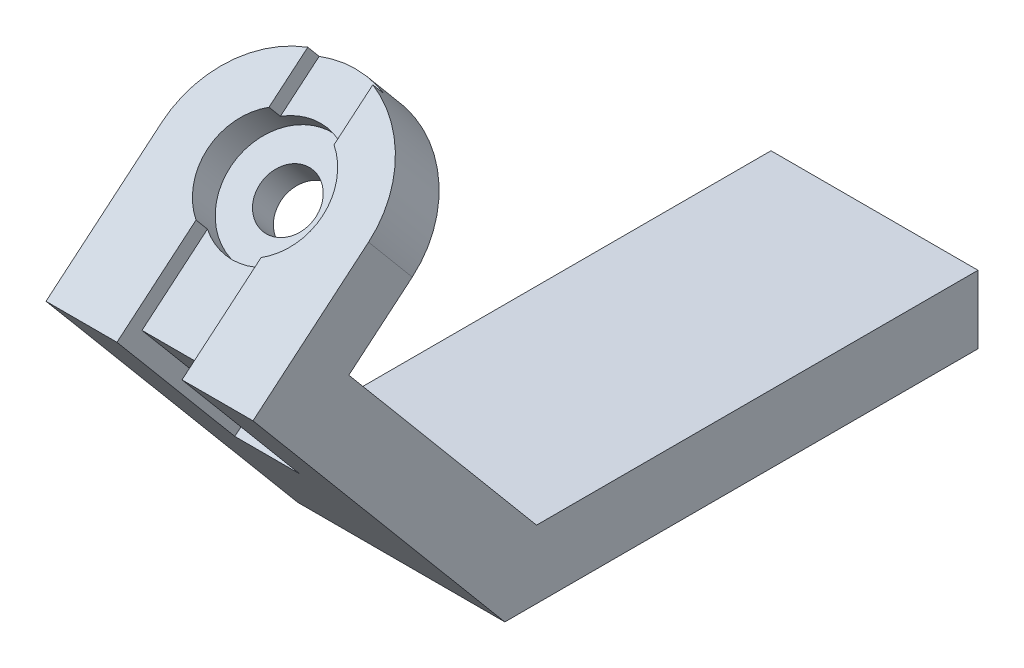
ISO-10303-21;
HEADER;
FILE_DESCRIPTION(('STEP AP214'),'2;1');
FILE_NAME('part.step','',(''),(''),'','','');
FILE_SCHEMA(('AUTOMOTIVE_DESIGN { 1 0 10303 214 1 1 1 1 }'));
ENDSEC;
DATA;
#1=APPLICATION_CONTEXT('core data for automotive mechanical design processes');
#2=APPLICATION_PROTOCOL_DEFINITION('international standard','automotive_design',2000,#1);
#3=PRODUCT_CONTEXT('',#1,'mechanical');
#4=PRODUCT('Part','Part','',(#3));
#5=PRODUCT_RELATED_PRODUCT_CATEGORY('part','',(#4));
#6=PRODUCT_DEFINITION_FORMATION('','',#4);
#7=PRODUCT_DEFINITION_CONTEXT('part definition',#1,'design');
#8=PRODUCT_DEFINITION('design','',#6,#7);
#9=PRODUCT_DEFINITION_SHAPE('','',#8);
#10=(LENGTH_UNIT() NAMED_UNIT(*) SI_UNIT(.MILLI.,.METRE.));
#11=(NAMED_UNIT(*) PLANE_ANGLE_UNIT() SI_UNIT($,.RADIAN.));
#12=(NAMED_UNIT(*) SI_UNIT($,.STERADIAN.) SOLID_ANGLE_UNIT());
#13=UNCERTAINTY_MEASURE_WITH_UNIT(LENGTH_MEASURE(1.E-05),#10,'distance_accuracy_value','');
#14=(GEOMETRIC_REPRESENTATION_CONTEXT(3) GLOBAL_UNCERTAINTY_ASSIGNED_CONTEXT((#13)) GLOBAL_UNIT_ASSIGNED_CONTEXT((#10,
#11,#12)) REPRESENTATION_CONTEXT('',''));
#15=CARTESIAN_POINT('',(0.,0.,0.));
#16=DIRECTION('',(0.,0.,1.));
#17=DIRECTION('',(1.,0.,0.));
#18=AXIS2_PLACEMENT_3D('',#15,#16,#17);
#19=CARTESIAN_POINT('',(0.,162.190581611374,136.094057210534));
#20=DIRECTION('',(0.,-0.766044443118974,-0.642787609686544));
#21=DIRECTION('',(0.,0.642787609686544,-0.766044443118974));
#22=AXIS2_PLACEMENT_3D('',#19,#20,#21);
#23=PLANE('',#22);
#24=DIRECTION('',(-1.,0.,0.));
#25=VECTOR('',#24,1.);
#26=CARTESIAN_POINT('',(-46.,77.7596410716863,236.714933924814));
#27=LINE('',#26,#25);
#28=CARTESIAN_POINT('',(-24.,77.7596410716862,236.714933924814));
#29=VERTEX_POINT('',#28);
#30=CARTESIAN_POINT('',(-46.,77.7596410716863,236.714933924814));
#31=VERTEX_POINT('',#30);
#32=EDGE_CURVE('E188',#29,#31,#27,.T.);
#33=ORIENTED_EDGE('',*,*,#32,.F.);
#34=DIRECTION('',(0.,0.642787609686544,-0.766044443118974));
#35=VECTOR('',#34,1.);
#36=CARTESIAN_POINT('',(-24.,73.902915413567,241.311200583528));
#37=LINE('',#36,#35);
#38=CARTESIAN_POINT('',(-24.,96.3354045285049,214.577201089971));
#39=VERTEX_POINT('',#38);
#40=EDGE_CURVE('E72',#29,#39,#37,.T.);
#41=ORIENTED_EDGE('',*,*,#40,.T.);
#42=CARTESIAN_POINT('',(-35.,106.685083507581,202.242933984461));
#43=DIRECTION('',(0.,-0.766044443118974,-0.642787609686544));
#44=DIRECTION('',(0.,0.642787609686544,-0.766044443118974));
#45=AXIS2_PLACEMENT_3D('',#42,#43,#44);
#46=CIRCLE('',#45,19.5);
#47=CARTESIAN_POINT('',(-46.,96.3354045285049,214.577201089971));
#48=VERTEX_POINT('',#47);
#49=EDGE_CURVE('E311',#48,#39,#46,.F.);
#50=ORIENTED_EDGE('',*,*,#49,.F.);
#51=DIRECTION('',(0.,-0.642787609686544,0.766044443118974));
#52=VECTOR('',#51,1.);
#53=CARTESIAN_POINT('',(-46.,73.902915413567,241.311200583528));
#54=LINE('',#53,#52);
#55=EDGE_CURVE('E204',#48,#31,#54,.T.);
#56=ORIENTED_EDGE('',*,*,#55,.T.);
#57=EDGE_LOOP('',(#33,#41,#50,#56));
#58=FACE_BOUND('',#57,.T.);
#59=ADVANCED_FACE('F50',(#58),#23,.F.);
#60=CARTESIAN_POINT('',(-70.,111.281350166295,206.09965964258));
#61=DIRECTION('',(0.,0.766044443118974,0.642787609686544));
#62=DIRECTION('',(0.,-0.642787609686544,0.766044443118974));
#63=AXIS2_PLACEMENT_3D('',#60,#61,#62);
#64=PLANE('',#63);
#65=DIRECTION('',(0.,-0.642787609686544,0.766044443118974));
#66=VECTOR('',#65,1.);
#67=CARTESIAN_POINT('',(-46.,78.4991820722808,245.167926241647));
#68=LINE('',#67,#66);
#69=CARTESIAN_POINT('',(-46.,132.638929755936,180.646687437508));
#70=VERTEX_POINT('',#69);
#71=CARTESIAN_POINT('',(-46.,121.631029145371,193.765392537069));
#72=VERTEX_POINT('',#71);
#73=EDGE_CURVE('E211',#70,#72,#68,.T.);
#74=ORIENTED_EDGE('',*,*,#73,.F.);
#75=CARTESIAN_POINT('',(-35.,111.281350166295,206.09965964258));
#76=DIRECTION('',(0.,0.766044443118974,0.642787609686544));
#77=DIRECTION('',(0.,-0.642787609686544,0.766044443118974));
#78=AXIS2_PLACEMENT_3D('',#75,#76,#77);
#79=CIRCLE('',#78,35.);
#80=CARTESIAN_POINT('',(-70.,111.281350166295,206.09965964258));
#81=VERTEX_POINT('',#80);
#82=EDGE_CURVE('E243',#81,#70,#79,.F.);
#83=ORIENTED_EDGE('',*,*,#82,.F.);
#84=DIRECTION('',(0.,-0.642787609686544,0.766044443118974));
#85=VECTOR('',#84,1.);
#86=CARTESIAN_POINT('',(-70.,111.281350166295,206.09965964258));
#87=LINE('',#86,#85);
#88=CARTESIAN_POINT('',(-70.,78.4991820722808,245.167926241647));
#89=VERTEX_POINT('',#88);
#90=EDGE_CURVE('E262',#81,#89,#87,.T.);
#91=ORIENTED_EDGE('',*,*,#90,.T.);
#92=DIRECTION('',(1.,0.,0.));
#93=VECTOR('',#92,1.);
#94=CARTESIAN_POINT('',(-70.,78.4991820722808,245.167926241647));
#95=LINE('',#94,#93);
#96=CARTESIAN_POINT('',(-46.,78.4991820722808,245.167926241647));
#97=VERTEX_POINT('',#96);
#98=EDGE_CURVE('E299',#89,#97,#95,.T.);
#99=ORIENTED_EDGE('',*,*,#98,.T.);
#100=CARTESIAN_POINT('',(-46.,100.931671187219,218.43392674809));
#101=VERTEX_POINT('',#100);
#102=EDGE_CURVE('E202',#101,#97,#68,.T.);
#103=ORIENTED_EDGE('',*,*,#102,.F.);
#104=CARTESIAN_POINT('',(-35.,111.281350166295,206.09965964258));
#105=DIRECTION('',(0.,0.766044443118974,0.642787609686544));
#106=DIRECTION('',(0.,-0.642787609686544,0.766044443118974));
#107=AXIS2_PLACEMENT_3D('',#104,#105,#106);
#108=CIRCLE('',#107,19.5);
#109=EDGE_CURVE('E226',#72,#101,#108,.T.);
#110=ORIENTED_EDGE('',*,*,#109,.F.);
#111=EDGE_LOOP('',(#74,#83,#91,#99,#103,#110));
#112=FACE_BOUND('',#111,.T.);
#113=ADVANCED_FACE('F327',(#112),#64,.T.);
#114=CARTESIAN_POINT('',(-35.,93.6623279745582,191.315544619789));
#115=DIRECTION('',(0.,0.766044443118974,0.642787609686544));
#116=DIRECTION('',(0.,-0.642787609686544,0.766044443118974));
#117=AXIS2_PLACEMENT_3D('',#114,#115,#116);
#118=CYLINDRICAL_SURFACE('',#117,9.5);
#119=CARTESIAN_POINT('',(-35.,93.6623279745582,191.315544619789));
#120=DIRECTION('',(0.,0.766044443118974,0.642787609686544));
#121=DIRECTION('',(0.,-0.642787609686544,0.766044443118974));
#122=AXIS2_PLACEMENT_3D('',#119,#120,#121);
#123=CIRCLE('',#122,9.5);
#124=CARTESIAN_POINT('',(-35.,87.555845682536,198.59296682942));
#125=VERTEX_POINT('',#124);
#126=EDGE_CURVE('E234',#125,#125,#123,.T.);
#127=ORIENTED_EDGE('',*,*,#126,.F.);
#128=EDGE_LOOP('',(#127));
#129=FACE_BOUND('',#128,.T.);
#130=CARTESIAN_POINT('',(-35.,102.088816848867,198.386208326341));
#131=DIRECTION('',(0.,0.766044443118974,0.642787609686544));
#132=DIRECTION('',(0.,-0.642787609686544,0.766044443118974));
#133=AXIS2_PLACEMENT_3D('',#130,#131,#132);
#134=CIRCLE('',#133,9.5);
#135=CARTESIAN_POINT('',(-35.,95.9823345568448,205.663630535971));
#136=VERTEX_POINT('',#135);
#137=EDGE_CURVE('E227',#136,#136,#134,.T.);
#138=ORIENTED_EDGE('',*,*,#137,.T.);
#139=EDGE_LOOP('',(#138));
#140=FACE_BOUND('',#139,.T.);
#141=ADVANCED_FACE('F392',(#129,#140),#118,.F.);
#142=CARTESIAN_POINT('',(-70.,-23.,0.));
#143=DIRECTION('',(0.,0.,-1.));
#144=DIRECTION('',(-1.,0.,0.));
#145=AXIS2_PLACEMENT_3D('',#142,#143,#144);
#146=PLANE('',#145);
#147=DIRECTION('',(0.,1.,0.));
#148=VECTOR('',#147,1.);
#149=CARTESIAN_POINT('',(0.,-23.,0.));
#150=LINE('',#149,#148);
#151=CARTESIAN_POINT('',(0.,-23.,0.));
#152=VERTEX_POINT('',#151);
#153=CARTESIAN_POINT('',(0.,0.,0.));
#154=VERTEX_POINT('',#153);
#155=EDGE_CURVE('E242',#152,#154,#150,.T.);
#156=ORIENTED_EDGE('',*,*,#155,.F.);
#157=DIRECTION('',(1.,0.,0.));
#158=VECTOR('',#157,1.);
#159=CARTESIAN_POINT('',(-70.,-23.,0.));
#160=LINE('',#159,#158);
#161=CARTESIAN_POINT('',(-70.,-23.,0.));
#162=VERTEX_POINT('',#161);
#163=EDGE_CURVE('E294',#162,#152,#160,.T.);
#164=ORIENTED_EDGE('',*,*,#163,.F.);
#165=DIRECTION('',(0.,1.,0.));
#166=VECTOR('',#165,1.);
#167=CARTESIAN_POINT('',(-70.,-23.,0.));
#168=LINE('',#167,#166);
#169=CARTESIAN_POINT('',(-70.,0.,0.));
#170=VERTEX_POINT('',#169);
#171=EDGE_CURVE('E246',#162,#170,#168,.T.);
#172=ORIENTED_EDGE('',*,*,#171,.T.);
#173=DIRECTION('',(1.,0.,0.));
#174=VECTOR('',#173,1.);
#175=CARTESIAN_POINT('',(-70.,0.,0.));
#176=LINE('',#175,#174);
#177=EDGE_CURVE('E271',#170,#154,#176,.T.);
#178=ORIENTED_EDGE('',*,*,#177,.T.);
#179=EDGE_LOOP('',(#156,#164,#172,#178));
#180=FACE_BOUND('',#179,.T.);
#181=ADVANCED_FACE('F52',(#180),#146,.T.);
#182=CARTESIAN_POINT('',(-70.,-23.,160.));
#183=DIRECTION('',(0.,-1.,0.));
#184=DIRECTION('',(0.,0.,-1.));
#185=AXIS2_PLACEMENT_3D('',#182,#183,#184);
#186=PLANE('',#185);
#187=DIRECTION('',(0.,0.,-1.));
#188=VECTOR('',#187,1.);
#189=CARTESIAN_POINT('',(0.,-23.,160.));
#190=LINE('',#189,#188);
#191=CARTESIAN_POINT('',(0.,-23.,160.));
#192=VERTEX_POINT('',#191);
#193=EDGE_CURVE('E250',#192,#152,#190,.T.);
#194=ORIENTED_EDGE('',*,*,#193,.F.);
#195=DIRECTION('',(1.,0.,0.));
#196=VECTOR('',#195,1.);
#197=CARTESIAN_POINT('',(-70.,-23.,160.));
#198=LINE('',#197,#196);
#199=CARTESIAN_POINT('',(-70.,-23.,160.));
#200=VERTEX_POINT('',#199);
#201=EDGE_CURVE('E297',#200,#192,#198,.T.);
#202=ORIENTED_EDGE('',*,*,#201,.F.);
#203=DIRECTION('',(0.,0.,-1.));
#204=VECTOR('',#203,1.);
#205=CARTESIAN_POINT('',(-70.,-23.,160.));
#206=LINE('',#205,#204);
#207=EDGE_CURVE('E268',#200,#162,#206,.T.);
#208=ORIENTED_EDGE('',*,*,#207,.T.);
#209=ORIENTED_EDGE('',*,*,#163,.T.);
#210=EDGE_LOOP('',(#194,#202,#208,#209));
#211=FACE_BOUND('',#210,.T.);
#212=ADVANCED_FACE('F372',(#211),#186,.T.);
#213=CARTESIAN_POINT('',(-70.,78.4991820722808,245.167926241647));
#214=DIRECTION('',(0.,-0.642787609686544,0.766044443118974));
#215=DIRECTION('',(0.,-0.766044443118974,-0.642787609686544));
#216=AXIS2_PLACEMENT_3D('',#213,#214,#215);
#217=PLANE('',#216);
#218=DIRECTION('',(1.,0.,0.));
#219=VECTOR('',#218,1.);
#220=CARTESIAN_POINT('',(-46.,31.0044265989044,205.315094441082));
#221=LINE('',#220,#219);
#222=CARTESIAN_POINT('',(-46.,31.0044265989044,205.315094441082));
#223=VERTEX_POINT('',#222);
#224=CARTESIAN_POINT('',(-24.,31.0044265989044,205.315094441082));
#225=VERTEX_POINT('',#224);
#226=EDGE_CURVE('E196',#223,#225,#221,.T.);
#227=ORIENTED_EDGE('',*,*,#226,.F.);
#228=DIRECTION('',(0.,0.766044443118974,0.642787609686544));
#229=VECTOR('',#228,1.);
#230=CARTESIAN_POINT('',(-46.,73.902915413567,241.311200583528));
#231=LINE('',#230,#229);
#232=EDGE_CURVE('E183',#223,#97,#231,.T.);
#233=ORIENTED_EDGE('',*,*,#232,.T.);
#234=ORIENTED_EDGE('',*,*,#98,.F.);
#235=DIRECTION('',(0.,-0.766044443118974,-0.642787609686544));
#236=VECTOR('',#235,1.);
#237=CARTESIAN_POINT('',(-70.,78.4991820722808,245.167926241647));
#238=LINE('',#237,#236);
#239=EDGE_CURVE('E265',#89,#200,#238,.T.);
#240=ORIENTED_EDGE('',*,*,#239,.T.);
#241=ORIENTED_EDGE('',*,*,#201,.T.);
#242=DIRECTION('',(0.,-0.766044443118974,-0.642787609686544));
#243=VECTOR('',#242,1.);
#244=CARTESIAN_POINT('',(0.,78.4991820722808,245.167926241647));
#245=LINE('',#244,#243);
#246=CARTESIAN_POINT('',(0.,78.4991820722808,245.167926241647));
#247=VERTEX_POINT('',#246);
#248=EDGE_CURVE('E289',#247,#192,#245,.T.);
#249=ORIENTED_EDGE('',*,*,#248,.F.);
#250=CARTESIAN_POINT('',(-24.,78.4991820722808,245.167926241647));
#251=VERTEX_POINT('',#250);
#252=EDGE_CURVE('E302',#251,#247,#95,.T.);
#253=ORIENTED_EDGE('',*,*,#252,.F.);
#254=DIRECTION('',(0.,0.766044443118974,0.642787609686544));
#255=VECTOR('',#254,1.);
#256=CARTESIAN_POINT('',(-24.,73.902915413567,241.311200583528));
#257=LINE('',#256,#255);
#258=EDGE_CURVE('E214',#225,#251,#257,.T.);
#259=ORIENTED_EDGE('',*,*,#258,.F.);
#260=EDGE_LOOP('',(#227,#233,#234,#240,#241,#249,#253,#259));
#261=FACE_BOUND('',#260,.T.);
#262=ADVANCED_FACE('F374',(#261),#217,.T.);
#263=DIRECTION('',(0.,0.642787609686544,-0.766044443118974));
#264=VECTOR('',#263,1.);
#265=CARTESIAN_POINT('',(-24.,78.4991820722808,245.167926241647));
#266=LINE('',#265,#264);
#267=CARTESIAN_POINT('',(-24.,100.931671187219,218.43392674809));
#268=VERTEX_POINT('',#267);
#269=EDGE_CURVE('E207',#251,#268,#266,.T.);
#270=ORIENTED_EDGE('',*,*,#269,.F.);
#271=ORIENTED_EDGE('',*,*,#252,.T.);
#272=DIRECTION('',(0.,-0.642787609686544,0.766044443118974));
#273=VECTOR('',#272,1.);
#274=CARTESIAN_POINT('',(0.,111.281350166295,206.09965964258));
#275=LINE('',#274,#273);
#276=CARTESIAN_POINT('',(0.,111.281350166295,206.09965964258));
#277=VERTEX_POINT('',#276);
#278=EDGE_CURVE('E286',#277,#247,#275,.T.);
#279=ORIENTED_EDGE('',*,*,#278,.F.);
#280=CARTESIAN_POINT('',(-24.,132.638929755936,180.646687437508));
#281=VERTEX_POINT('',#280);
#282=EDGE_CURVE('E239',#281,#277,#79,.F.);
#283=ORIENTED_EDGE('',*,*,#282,.F.);
#284=CARTESIAN_POINT('',(-24.,121.631029145371,193.765392537069));
#285=VERTEX_POINT('',#284);
#286=EDGE_CURVE('E213',#285,#281,#266,.T.);
#287=ORIENTED_EDGE('',*,*,#286,.F.);
#288=EDGE_CURVE('E231',#268,#285,#108,.T.);
#289=ORIENTED_EDGE('',*,*,#288,.F.);
#290=EDGE_LOOP('',(#270,#271,#279,#283,#287,#289));
#291=FACE_BOUND('',#290,.T.);
#292=ADVANCED_FACE('F344',(#291),#64,.T.);
#293=CARTESIAN_POINT('',(-70.,75.6642749033349,212.764789027121));
#294=DIRECTION('',(0.,-0.766044443118975,-0.642787609686543));
#295=DIRECTION('',(0.,0.642787609686543,-0.766044443118975));
#296=AXIS2_PLACEMENT_3D('',#293,#294,#295);
#297=PLANE('',#296);
#298=ORIENTED_EDGE('',*,*,#126,.T.);
#299=EDGE_LOOP('',(#298));
#300=FACE_BOUND('',#299,.T.);
#301=DIRECTION('',(0.,0.642787609686543,-0.766044443118975));
#302=VECTOR('',#301,1.);
#303=CARTESIAN_POINT('',(-70.,75.6642749033349,212.764789027121));
#304=LINE('',#303,#302);
#305=CARTESIAN_POINT('',(-70.,75.6642749033349,212.764789027121));
#306=VERTEX_POINT('',#305);
#307=CARTESIAN_POINT('',(-70.,93.6623279745582,191.315544619789));
#308=VERTEX_POINT('',#307);
#309=EDGE_CURVE('E256',#306,#308,#304,.T.);
#310=ORIENTED_EDGE('',*,*,#309,.T.);
#311=CARTESIAN_POINT('',(-35.,93.6623279745582,191.315544619789));
#312=DIRECTION('',(0.,0.766044443118974,0.642787609686544));
#313=DIRECTION('',(0.,-0.642787609686544,0.766044443118974));
#314=AXIS2_PLACEMENT_3D('',#311,#312,#313);
#315=CIRCLE('',#314,35.);
#316=CARTESIAN_POINT('',(0.,93.6623279745582,191.315544619789));
#317=VERTEX_POINT('',#316);
#318=EDGE_CURVE('E240',#308,#317,#315,.F.);
#319=ORIENTED_EDGE('',*,*,#318,.T.);
#320=DIRECTION('',(0.,0.642787609686543,-0.766044443118975));
#321=VECTOR('',#320,1.);
#322=CARTESIAN_POINT('',(0.,75.6642749033349,212.764789027121));
#323=LINE('',#322,#321);
#324=CARTESIAN_POINT('',(0.,75.6642749033349,212.764789027121));
#325=VERTEX_POINT('',#324);
#326=EDGE_CURVE('E280',#325,#317,#323,.T.);
#327=ORIENTED_EDGE('',*,*,#326,.F.);
#328=DIRECTION('',(1.,0.,0.));
#329=VECTOR('',#328,1.);
#330=CARTESIAN_POINT('',(-70.,75.6642749033349,212.764789027121));
#331=LINE('',#330,#329);
#332=EDGE_CURVE('E303',#306,#325,#331,.T.);
#333=ORIENTED_EDGE('',*,*,#332,.F.);
#334=EDGE_LOOP('',(#310,#319,#327,#333));
#335=FACE_BOUND('',#334,.T.);
#336=ADVANCED_FACE('F359',(#300,#335),#297,.T.);
#337=CARTESIAN_POINT('',(-70.,0.,149.274923862435));
#338=DIRECTION('',(0.,0.642787609686544,-0.766044443118974));
#339=DIRECTION('',(0.,0.766044443118974,0.642787609686544));
#340=AXIS2_PLACEMENT_3D('',#337,#338,#339);
#341=PLANE('',#340);
#342=DIRECTION('',(0.,0.766044443118974,0.642787609686544));
#343=VECTOR('',#342,1.);
#344=CARTESIAN_POINT('',(0.,0.,149.274923862435));
#345=LINE('',#344,#343);
#346=CARTESIAN_POINT('',(0.,0.,149.274923862435));
#347=VERTEX_POINT('',#346);
#348=EDGE_CURVE('E277',#347,#325,#345,.T.);
#349=ORIENTED_EDGE('',*,*,#348,.F.);
#350=DIRECTION('',(1.,0.,0.));
#351=VECTOR('',#350,1.);
#352=CARTESIAN_POINT('',(-70.,0.,149.274923862435));
#353=LINE('',#352,#351);
#354=CARTESIAN_POINT('',(-70.,0.,149.274923862435));
#355=VERTEX_POINT('',#354);
#356=EDGE_CURVE('E305',#355,#347,#353,.T.);
#357=ORIENTED_EDGE('',*,*,#356,.F.);
#358=DIRECTION('',(0.,0.766044443118974,0.642787609686544));
#359=VECTOR('',#358,1.);
#360=CARTESIAN_POINT('',(-70.,0.,149.274923862435));
#361=LINE('',#360,#359);
#362=EDGE_CURVE('E253',#355,#306,#361,.T.);
#363=ORIENTED_EDGE('',*,*,#362,.T.);
#364=ORIENTED_EDGE('',*,*,#332,.T.);
#365=EDGE_LOOP('',(#349,#357,#363,#364));
#366=FACE_BOUND('',#365,.T.);
#367=ADVANCED_FACE('F362',(#366),#341,.T.);
#368=CARTESIAN_POINT('',(-70.,0.,0.));
#369=DIRECTION('',(0.,1.,0.));
#370=DIRECTION('',(0.,0.,1.));
#371=AXIS2_PLACEMENT_3D('',#368,#369,#370);
#372=PLANE('',#371);
#373=DIRECTION('',(0.,0.,1.));
#374=VECTOR('',#373,1.);
#375=CARTESIAN_POINT('',(0.,0.,0.));
#376=LINE('',#375,#374);
#377=EDGE_CURVE('E274',#154,#347,#376,.T.);
#378=ORIENTED_EDGE('',*,*,#377,.F.);
#379=ORIENTED_EDGE('',*,*,#177,.F.);
#380=DIRECTION('',(0.,0.,1.));
#381=VECTOR('',#380,1.);
#382=CARTESIAN_POINT('',(-70.,0.,0.));
#383=LINE('',#382,#381);
#384=EDGE_CURVE('E249',#170,#355,#383,.T.);
#385=ORIENTED_EDGE('',*,*,#384,.T.);
#386=ORIENTED_EDGE('',*,*,#356,.T.);
#387=EDGE_LOOP('',(#378,#379,#385,#386));
#388=FACE_BOUND('',#387,.T.);
#389=ADVANCED_FACE('F366',(#388),#372,.T.);
#390=CARTESIAN_POINT('',(-70.,0.,0.));
#391=DIRECTION('',(1.,0.,0.));
#392=DIRECTION('',(0.,0.,-1.));
#393=AXIS2_PLACEMENT_3D('',#390,#391,#392);
#394=PLANE('',#393);
#395=ORIENTED_EDGE('',*,*,#171,.F.);
#396=ORIENTED_EDGE('',*,*,#207,.F.);
#397=ORIENTED_EDGE('',*,*,#239,.F.);
#398=ORIENTED_EDGE('',*,*,#90,.F.);
#399=DIRECTION('',(0.,0.766044443118975,0.642787609686543));
#400=VECTOR('',#399,1.);
#401=CARTESIAN_POINT('',(-70.,93.6623279745581,191.315544619789));
#402=LINE('',#401,#400);
#403=EDGE_CURVE('E259',#308,#81,#402,.T.);
#404=ORIENTED_EDGE('',*,*,#403,.F.);
#405=ORIENTED_EDGE('',*,*,#309,.F.);
#406=ORIENTED_EDGE('',*,*,#362,.F.);
#407=ORIENTED_EDGE('',*,*,#384,.F.);
#408=EDGE_LOOP('',(#395,#396,#397,#398,#404,#405,#406,#407));
#409=FACE_BOUND('',#408,.T.);
#410=ADVANCED_FACE('F356',(#409),#394,.F.);
#411=CARTESIAN_POINT('',(0.,0.,0.));
#412=DIRECTION('',(1.,0.,0.));
#413=DIRECTION('',(0.,0.,-1.));
#414=AXIS2_PLACEMENT_3D('',#411,#412,#413);
#415=PLANE('',#414);
#416=ORIENTED_EDGE('',*,*,#155,.T.);
#417=ORIENTED_EDGE('',*,*,#377,.T.);
#418=ORIENTED_EDGE('',*,*,#348,.T.);
#419=ORIENTED_EDGE('',*,*,#326,.T.);
#420=DIRECTION('',(0.,0.766044443118975,0.642787609686543));
#421=VECTOR('',#420,1.);
#422=CARTESIAN_POINT('',(0.,93.6623279745581,191.315544619789));
#423=LINE('',#422,#421);
#424=EDGE_CURVE('E283',#317,#277,#423,.T.);
#425=ORIENTED_EDGE('',*,*,#424,.T.);
#426=ORIENTED_EDGE('',*,*,#278,.T.);
#427=ORIENTED_EDGE('',*,*,#248,.T.);
#428=ORIENTED_EDGE('',*,*,#193,.T.);
#429=EDGE_LOOP('',(#416,#417,#418,#419,#425,#426,#427,#428));
#430=FACE_BOUND('',#429,.T.);
#431=ADVANCED_FACE('F348',(#430),#415,.T.);
#432=CARTESIAN_POINT('',(-35.,93.6623279745582,191.315544619789));
#433=DIRECTION('',(0.,0.766044443118974,0.642787609686544));
#434=DIRECTION('',(0.,-0.642787609686544,0.766044443118974));
#435=AXIS2_PLACEMENT_3D('',#432,#433,#434);
#436=CYLINDRICAL_SURFACE('',#435,35.);
#437=ORIENTED_EDGE('',*,*,#82,.T.);
#438=DIRECTION('',(0.,0.766044443118974,0.642787609686544));
#439=VECTOR('',#438,1.);
#440=CARTESIAN_POINT('',(-46.,115.019907564199,165.862572414718));
#441=LINE('',#440,#439);
#442=CARTESIAN_POINT('',(-46.,128.042663097222,176.789961779389));
#443=VERTEX_POINT('',#442);
#444=EDGE_CURVE('E223',#70,#443,#441,.F.);
#445=ORIENTED_EDGE('',*,*,#444,.T.);
#446=CARTESIAN_POINT('',(-35.,106.685083507581,202.242933984461));
#447=DIRECTION('',(0.,-0.766044443118974,-0.642787609686544));
#448=DIRECTION('',(0.,0.642787609686544,-0.766044443118974));
#449=AXIS2_PLACEMENT_3D('',#446,#447,#448);
#450=CIRCLE('',#449,35.);
#451=CARTESIAN_POINT('',(-24.,128.042663097222,176.789961779389));
#452=VERTEX_POINT('',#451);
#453=EDGE_CURVE('E216',#443,#452,#450,.T.);
#454=ORIENTED_EDGE('',*,*,#453,.T.);
#455=DIRECTION('',(0.,0.766044443118974,0.642787609686544));
#456=VECTOR('',#455,1.);
#457=CARTESIAN_POINT('',(-24.,115.019907564199,165.862572414718));
#458=LINE('',#457,#456);
#459=EDGE_CURVE('E220',#452,#281,#458,.T.);
#460=ORIENTED_EDGE('',*,*,#459,.T.);
#461=ORIENTED_EDGE('',*,*,#282,.T.);
#462=ORIENTED_EDGE('',*,*,#424,.F.);
#463=ORIENTED_EDGE('',*,*,#318,.F.);
#464=ORIENTED_EDGE('',*,*,#403,.T.);
#465=EDGE_LOOP('',(#437,#445,#454,#460,#461,#462,#463,#464));
#466=FACE_BOUND('',#465,.T.);
#467=ADVANCED_FACE('F340',(#466),#436,.T.);
#468=CARTESIAN_POINT('',(-35.,102.088816848867,198.386208326341));
#469=DIRECTION('',(0.,0.766044443118974,0.642787609686544));
#470=DIRECTION('',(0.,-0.642787609686544,0.766044443118974));
#471=AXIS2_PLACEMENT_3D('',#468,#469,#470);
#472=CYLINDRICAL_SURFACE('',#471,19.5);
#473=ORIENTED_EDGE('',*,*,#109,.T.);
#474=DIRECTION('',(0.,0.766044443118974,0.642787609686544));
#475=VECTOR('',#474,1.);
#476=CARTESIAN_POINT('',(-46.,91.739137869791,210.720475431852));
#477=LINE('',#476,#475);
#478=EDGE_CURVE('E12',#101,#48,#477,.F.);
#479=ORIENTED_EDGE('',*,*,#478,.T.);
#480=ORIENTED_EDGE('',*,*,#49,.T.);
#481=DIRECTION('',(0.,0.766044443118974,0.642787609686544));
#482=VECTOR('',#481,1.);
#483=CARTESIAN_POINT('',(-24.,91.739137869791,210.720475431852));
#484=LINE('',#483,#482);
#485=EDGE_CURVE('E58',#39,#268,#484,.T.);
#486=ORIENTED_EDGE('',*,*,#485,.T.);
#487=ORIENTED_EDGE('',*,*,#288,.T.);
#488=DIRECTION('',(0.,0.766044443118974,0.642787609686544));
#489=VECTOR('',#488,1.);
#490=CARTESIAN_POINT('',(-24.,112.438495827943,186.051941220831));
#491=LINE('',#490,#489);
#492=CARTESIAN_POINT('',(-24.,117.034762486657,189.90866687895));
#493=VERTEX_POINT('',#492);
#494=EDGE_CURVE('E310',#285,#493,#491,.F.);
#495=ORIENTED_EDGE('',*,*,#494,.T.);
#496=CARTESIAN_POINT('',(-46.,117.034762486657,189.90866687895));
#497=VERTEX_POINT('',#496);
#498=EDGE_CURVE('E296',#493,#497,#46,.F.);
#499=ORIENTED_EDGE('',*,*,#498,.T.);
#500=DIRECTION('',(0.,0.766044443118974,0.642787609686544));
#501=VECTOR('',#500,1.);
#502=CARTESIAN_POINT('',(-46.,112.438495827943,186.051941220831));
#503=LINE('',#502,#501);
#504=EDGE_CURVE('E314',#497,#72,#503,.T.);
#505=ORIENTED_EDGE('',*,*,#504,.T.);
#506=EDGE_LOOP('',(#473,#479,#480,#486,#487,#495,#499,#505));
#507=FACE_BOUND('',#506,.T.);
#508=CARTESIAN_POINT('',(-35.,102.088816848867,198.386208326341));
#509=DIRECTION('',(0.,0.766044443118974,0.642787609686544));
#510=DIRECTION('',(0.,-0.642787609686544,0.766044443118974));
#511=AXIS2_PLACEMENT_3D('',#508,#509,#510);
#512=CIRCLE('',#511,19.5);
#513=CARTESIAN_POINT('',(-35.,89.5544584599793,213.324074967161));
#514=VERTEX_POINT('',#513);
#515=EDGE_CURVE('E230',#514,#514,#512,.T.);
#516=ORIENTED_EDGE('',*,*,#515,.F.);
#517=EDGE_LOOP('',(#516));
#518=FACE_BOUND('',#517,.T.);
#519=ADVANCED_FACE('F321',(#507,#518),#472,.F.);
#520=CARTESIAN_POINT('',(0.,157.59431495266,132.237331552415));
#521=DIRECTION('',(0.,0.766044443118974,0.642787609686544));
#522=DIRECTION('',(0.,-0.642787609686544,0.766044443118974));
#523=AXIS2_PLACEMENT_3D('',#520,#521,#522);
#524=PLANE('',#523);
#525=ORIENTED_EDGE('',*,*,#137,.F.);
#526=EDGE_LOOP('',(#525));
#527=FACE_BOUND('',#526,.T.);
#528=ORIENTED_EDGE('',*,*,#515,.T.);
#529=EDGE_LOOP('',(#528));
#530=FACE_BOUND('',#529,.T.);
#531=ADVANCED_FACE('F395',(#527,#530),#524,.T.);
#532=EDGE_CURVE('E206',#443,#497,#54,.T.);
#533=ORIENTED_EDGE('',*,*,#532,.T.);
#534=ORIENTED_EDGE('',*,*,#498,.F.);
#535=EDGE_CURVE('E209',#493,#452,#37,.T.);
#536=ORIENTED_EDGE('',*,*,#535,.T.);
#537=ORIENTED_EDGE('',*,*,#453,.F.);
#538=EDGE_LOOP('',(#533,#534,#536,#537));
#539=FACE_BOUND('',#538,.T.);
#540=ADVANCED_FACE('F387',(#539),#23,.F.);
#541=CARTESIAN_POINT('',(-24.,73.902915413567,241.311200583528));
#542=DIRECTION('',(1.,0.,0.));
#543=DIRECTION('',(0.,0.,-1.));
#544=AXIS2_PLACEMENT_3D('',#541,#542,#543);
#545=PLANE('',#544);
#546=ORIENTED_EDGE('',*,*,#535,.F.);
#547=ORIENTED_EDGE('',*,*,#494,.F.);
#548=ORIENTED_EDGE('',*,*,#286,.T.);
#549=ORIENTED_EDGE('',*,*,#459,.F.);
#550=EDGE_LOOP('',(#546,#547,#548,#549));
#551=FACE_BOUND('',#550,.T.);
#552=ADVANCED_FACE('F335',(#551),#545,.F.);
#553=CARTESIAN_POINT('',(-46.,73.902915413567,241.311200583528));
#554=DIRECTION('',(-1.,0.,0.));
#555=DIRECTION('',(0.,0.,1.));
#556=AXIS2_PLACEMENT_3D('',#553,#554,#555);
#557=PLANE('',#556);
#558=ORIENTED_EDGE('',*,*,#73,.T.);
#559=ORIENTED_EDGE('',*,*,#504,.F.);
#560=ORIENTED_EDGE('',*,*,#532,.F.);
#561=ORIENTED_EDGE('',*,*,#444,.F.);
#562=EDGE_LOOP('',(#558,#559,#560,#561));
#563=FACE_BOUND('',#562,.T.);
#564=ADVANCED_FACE('F331',(#563),#557,.F.);
#565=ORIENTED_EDGE('',*,*,#102,.T.);
#566=ORIENTED_EDGE('',*,*,#232,.F.);
#567=DIRECTION('',(0.,-0.642787609686544,0.766044443118974));
#568=VECTOR('',#567,1.);
#569=CARTESIAN_POINT('',(-46.,34.8611522570237,200.718827782368));
#570=LINE('',#569,#568);
#571=CARTESIAN_POINT('',(-46.,34.8611522570237,200.718827782368));
#572=VERTEX_POINT('',#571);
#573=EDGE_CURVE('E176',#572,#223,#570,.T.);
#574=ORIENTED_EDGE('',*,*,#573,.F.);
#575=DIRECTION('',(0.,-0.766044443118975,-0.642787609686544));
#576=VECTOR('',#575,1.);
#577=CARTESIAN_POINT('',(-46.,77.7596410716863,236.714933924814));
#578=LINE('',#577,#576);
#579=EDGE_CURVE('E181',#31,#572,#578,.T.);
#580=ORIENTED_EDGE('',*,*,#579,.F.);
#581=ORIENTED_EDGE('',*,*,#55,.F.);
#582=ORIENTED_EDGE('',*,*,#478,.F.);
#583=EDGE_LOOP('',(#565,#566,#574,#580,#581,#582));
#584=FACE_BOUND('',#583,.T.);
#585=ADVANCED_FACE('F178',(#584),#557,.F.);
#586=ORIENTED_EDGE('',*,*,#40,.F.);
#587=DIRECTION('',(0.,0.766044443118975,0.642787609686544));
#588=VECTOR('',#587,1.);
#589=CARTESIAN_POINT('',(-24.,77.7596410716863,236.714933924814));
#590=LINE('',#589,#588);
#591=CARTESIAN_POINT('',(-24.,34.8611522570237,200.718827782368));
#592=VERTEX_POINT('',#591);
#593=EDGE_CURVE('E65',#592,#29,#590,.T.);
#594=ORIENTED_EDGE('',*,*,#593,.F.);
#595=DIRECTION('',(0.,-0.642787609686544,0.766044443118974));
#596=VECTOR('',#595,1.);
#597=CARTESIAN_POINT('',(-24.,34.8611522570237,200.718827782368));
#598=LINE('',#597,#596);
#599=EDGE_CURVE('E187',#592,#225,#598,.T.);
#600=ORIENTED_EDGE('',*,*,#599,.T.);
#601=ORIENTED_EDGE('',*,*,#258,.T.);
#602=ORIENTED_EDGE('',*,*,#269,.T.);
#603=ORIENTED_EDGE('',*,*,#485,.F.);
#604=EDGE_LOOP('',(#586,#594,#600,#601,#602,#603));
#605=FACE_BOUND('',#604,.T.);
#606=ADVANCED_FACE('F376',(#605),#545,.F.);
#607=CARTESIAN_POINT('',(-46.,34.8611522570237,200.718827782368));
#608=DIRECTION('',(0.,-0.766044443118974,-0.642787609686544));
#609=DIRECTION('',(0.,0.642787609686544,-0.766044443118974));
#610=AXIS2_PLACEMENT_3D('',#607,#608,#609);
#611=PLANE('',#610);
#612=ORIENTED_EDGE('',*,*,#226,.T.);
#613=ORIENTED_EDGE('',*,*,#599,.F.);
#614=DIRECTION('',(1.,0.,0.));
#615=VECTOR('',#614,1.);
#616=CARTESIAN_POINT('',(-46.,34.8611522570237,200.718827782368));
#617=LINE('',#616,#615);
#618=EDGE_CURVE('E190',#572,#592,#617,.T.);
#619=ORIENTED_EDGE('',*,*,#618,.F.);
#620=ORIENTED_EDGE('',*,*,#573,.T.);
#621=EDGE_LOOP('',(#612,#613,#619,#620));
#622=FACE_BOUND('',#621,.T.);
#623=ADVANCED_FACE('F191',(#622),#611,.F.);
#624=CARTESIAN_POINT('',(0.,-84.430940539688,100.62087671428));
#625=DIRECTION('',(0.,-0.642787609686544,0.766044443118975));
#626=DIRECTION('',(0.,-0.766044443118975,-0.642787609686544));
#627=AXIS2_PLACEMENT_3D('',#624,#625,#626);
#628=PLANE('',#627);
#629=ORIENTED_EDGE('',*,*,#579,.T.);
#630=ORIENTED_EDGE('',*,*,#618,.T.);
#631=ORIENTED_EDGE('',*,*,#593,.T.);
#632=ORIENTED_EDGE('',*,*,#32,.T.);
#633=EDGE_LOOP('',(#629,#630,#631,#632));
#634=FACE_BOUND('',#633,.T.);
#635=ADVANCED_FACE('F194',(#634),#628,.T.);
#636=CLOSED_SHELL('',(#59,#113,#141,#181,#212,#262,#292,#336,#367,#389,#410,#431,#467,#519,#531,
#540,#552,#564,#585,#606,#623,#635));
#637=MANIFOLD_SOLID_BREP('B2',#636);
#638=ADVANCED_BREP_SHAPE_REPRESENTATION('',(#18,#637),#14);
#639=SHAPE_DEFINITION_REPRESENTATION(#9,#638);
ENDSEC;
END-ISO-10303-21;
